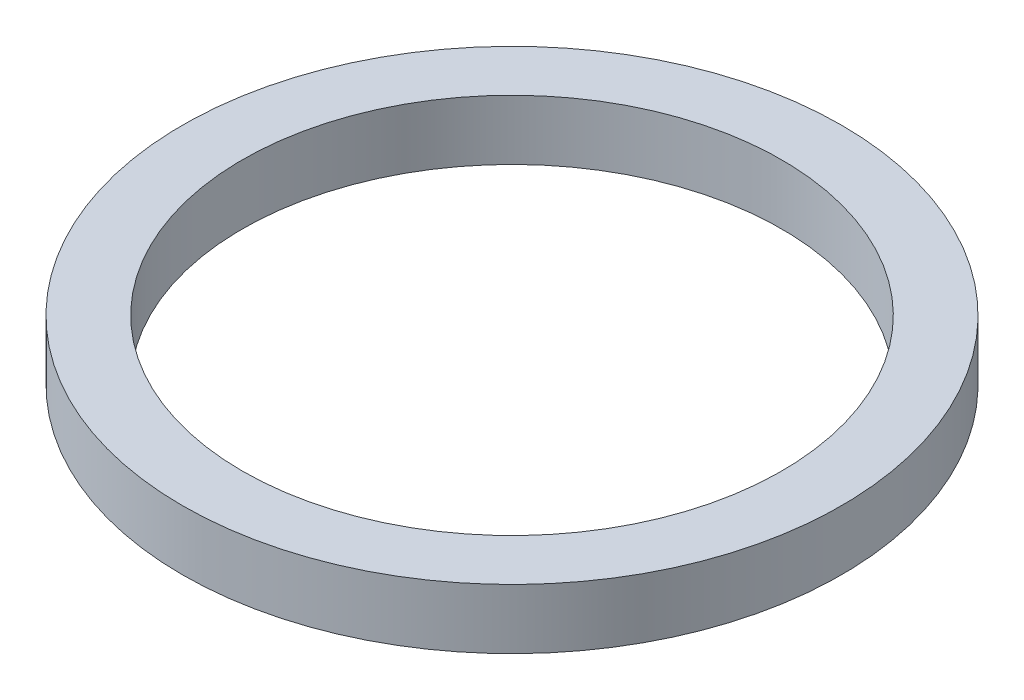
ISO-10303-21;
HEADER;
FILE_DESCRIPTION(('STEP AP214'),'2;1');
FILE_NAME('part.step','',(''),(''),'','','');
FILE_SCHEMA(('AUTOMOTIVE_DESIGN { 1 0 10303 214 1 1 1 1 }'));
ENDSEC;
DATA;
#1=APPLICATION_CONTEXT('core data for automotive mechanical design processes');
#2=APPLICATION_PROTOCOL_DEFINITION('international standard','automotive_design',2000,#1);
#3=PRODUCT_CONTEXT('',#1,'mechanical');
#4=PRODUCT('Part','Part','',(#3));
#5=PRODUCT_RELATED_PRODUCT_CATEGORY('part','',(#4));
#6=PRODUCT_DEFINITION_FORMATION('','',#4);
#7=PRODUCT_DEFINITION_CONTEXT('part definition',#1,'design');
#8=PRODUCT_DEFINITION('design','',#6,#7);
#9=PRODUCT_DEFINITION_SHAPE('','',#8);
#10=(LENGTH_UNIT() NAMED_UNIT(*) SI_UNIT(.MILLI.,.METRE.));
#11=(NAMED_UNIT(*) PLANE_ANGLE_UNIT() SI_UNIT($,.RADIAN.));
#12=(NAMED_UNIT(*) SI_UNIT($,.STERADIAN.) SOLID_ANGLE_UNIT());
#13=UNCERTAINTY_MEASURE_WITH_UNIT(LENGTH_MEASURE(1.E-05),#10,'distance_accuracy_value','');
#14=(GEOMETRIC_REPRESENTATION_CONTEXT(3) GLOBAL_UNCERTAINTY_ASSIGNED_CONTEXT((#13)) GLOBAL_UNIT_ASSIGNED_CONTEXT((#10,
#11,#12)) REPRESENTATION_CONTEXT('',''));
#15=CARTESIAN_POINT('',(0.,0.,0.));
#16=DIRECTION('',(0.,0.,1.));
#17=DIRECTION('',(1.,0.,0.));
#18=AXIS2_PLACEMENT_3D('',#15,#16,#17);
#19=CARTESIAN_POINT('',(0.,34.1328865979381,0.));
#20=DIRECTION('',(0.,1.,0.));
#21=DIRECTION('',(0.,0.,1.));
#22=AXIS2_PLACEMENT_3D('',#19,#20,#21);
#23=CYLINDRICAL_SURFACE('',#22,9.00000000000001);
#24=CARTESIAN_POINT('',(0.,0.720102999999993,0.));
#25=DIRECTION('',(0.,1.,0.));
#26=DIRECTION('',(0.,0.,1.));
#27=AXIS2_PLACEMENT_3D('',#24,#25,#26);
#28=CIRCLE('',#27,9.00000000000001);
#29=CARTESIAN_POINT('',(0.,0.720102999999993,9.00000000000001));
#30=VERTEX_POINT('',#29);
#31=EDGE_CURVE('E45',#30,#30,#28,.T.);
#32=ORIENTED_EDGE('',*,*,#31,.F.);
#33=EDGE_LOOP('',(#32));
#34=FACE_BOUND('',#33,.T.);
#35=CARTESIAN_POINT('',(0.,2.72010299999999,0.));
#36=DIRECTION('',(0.,1.,0.));
#37=DIRECTION('',(0.,0.,1.));
#38=AXIS2_PLACEMENT_3D('',#35,#36,#37);
#39=CIRCLE('',#38,9.00000000000001);
#40=CARTESIAN_POINT('',(0.,2.72010299999999,9.00000000000001));
#41=VERTEX_POINT('',#40);
#42=EDGE_CURVE('E10',#41,#41,#39,.T.);
#43=ORIENTED_EDGE('',*,*,#42,.T.);
#44=EDGE_LOOP('',(#43));
#45=FACE_BOUND('',#44,.T.);
#46=ADVANCED_FACE('F31',(#34,#45),#23,.F.);
#47=CARTESIAN_POINT('',(9.00000000000001,2.720103,0.));
#48=DIRECTION('',(0.,-1.,0.));
#49=DIRECTION('',(0.,0.,-1.));
#50=AXIS2_PLACEMENT_3D('',#47,#48,#49);
#51=PLANE('',#50);
#52=ORIENTED_EDGE('',*,*,#42,.F.);
#53=EDGE_LOOP('',(#52));
#54=FACE_BOUND('',#53,.T.);
#55=CARTESIAN_POINT('',(0.,2.72010299999999,0.));
#56=DIRECTION('',(0.,1.,0.));
#57=DIRECTION('',(0.,0.,1.));
#58=AXIS2_PLACEMENT_3D('',#55,#56,#57);
#59=CIRCLE('',#58,11.);
#60=CARTESIAN_POINT('',(0.,2.72010299999999,11.));
#61=VERTEX_POINT('',#60);
#62=EDGE_CURVE('E37',#61,#61,#59,.T.);
#63=ORIENTED_EDGE('',*,*,#62,.T.);
#64=EDGE_LOOP('',(#63));
#65=FACE_BOUND('',#64,.T.);
#66=ADVANCED_FACE('F54',(#54,#65),#51,.F.);
#67=CARTESIAN_POINT('',(0.,34.1328865979381,0.));
#68=DIRECTION('',(0.,1.,0.));
#69=DIRECTION('',(0.,0.,1.));
#70=AXIS2_PLACEMENT_3D('',#67,#68,#69);
#71=CYLINDRICAL_SURFACE('',#70,11.);
#72=ORIENTED_EDGE('',*,*,#62,.F.);
#73=EDGE_LOOP('',(#72));
#74=FACE_BOUND('',#73,.T.);
#75=CARTESIAN_POINT('',(0.,0.720103,0.));
#76=DIRECTION('',(0.,1.,0.));
#77=DIRECTION('',(0.,0.,1.));
#78=AXIS2_PLACEMENT_3D('',#75,#76,#77);
#79=CIRCLE('',#78,11.);
#80=CARTESIAN_POINT('',(0.,0.720103,11.));
#81=VERTEX_POINT('',#80);
#82=EDGE_CURVE('E41',#81,#81,#79,.T.);
#83=ORIENTED_EDGE('',*,*,#82,.T.);
#84=EDGE_LOOP('',(#83));
#85=FACE_BOUND('',#84,.T.);
#86=ADVANCED_FACE('F58',(#74,#85),#71,.T.);
#87=CARTESIAN_POINT('',(11.,0.720102999999996,0.));
#88=DIRECTION('',(0.,1.,0.));
#89=DIRECTION('',(0.,0.,1.));
#90=AXIS2_PLACEMENT_3D('',#87,#88,#89);
#91=PLANE('',#90);
#92=ORIENTED_EDGE('',*,*,#82,.F.);
#93=EDGE_LOOP('',(#92));
#94=FACE_BOUND('',#93,.T.);
#95=ORIENTED_EDGE('',*,*,#31,.T.);
#96=EDGE_LOOP('',(#95));
#97=FACE_BOUND('',#96,.T.);
#98=ADVANCED_FACE('F51',(#94,#97),#91,.F.);
#99=CLOSED_SHELL('',(#46,#66,#86,#98));
#100=MANIFOLD_SOLID_BREP('B2',#99);
#101=ADVANCED_BREP_SHAPE_REPRESENTATION('',(#18,#100),#14);
#102=SHAPE_DEFINITION_REPRESENTATION(#9,#101);
ENDSEC;
END-ISO-10303-21;
